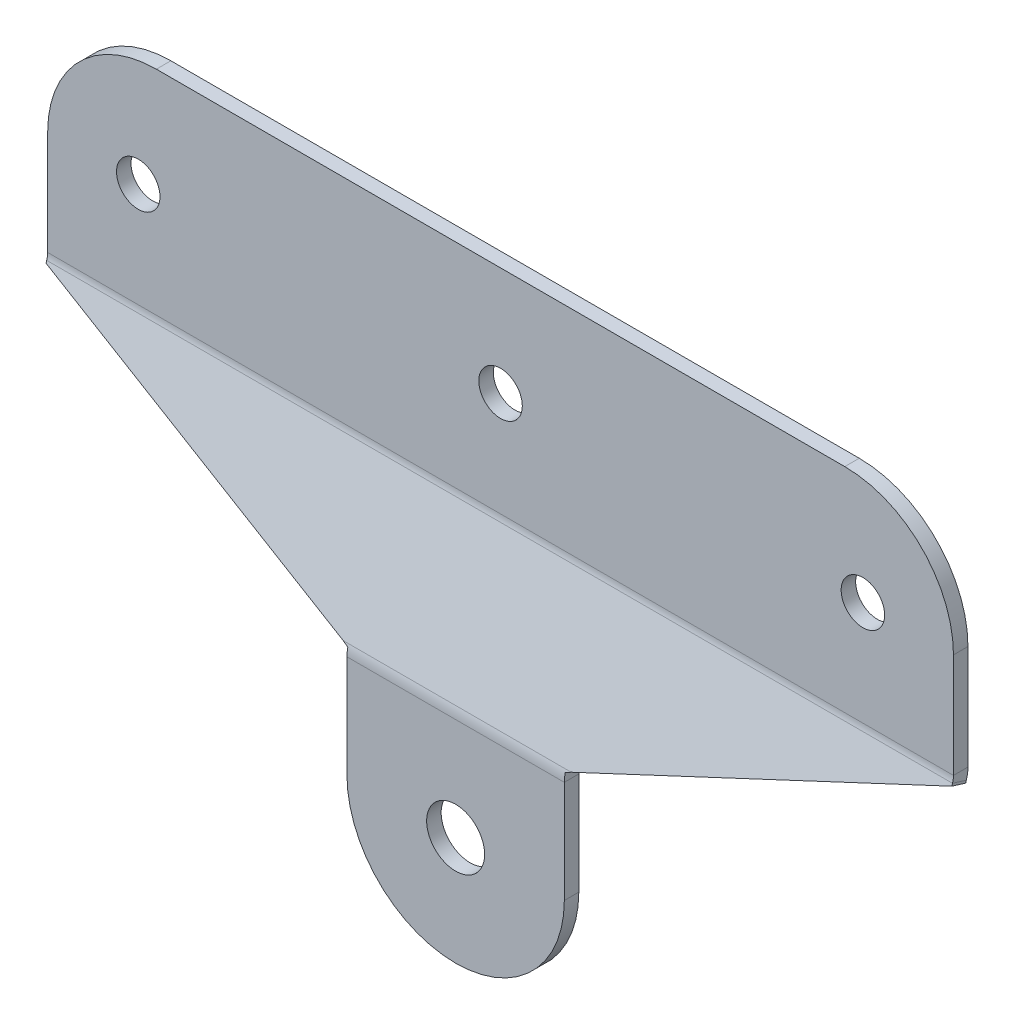
ISO-10303-21;
HEADER;
FILE_DESCRIPTION(('STEP AP214'),'2;1');
FILE_NAME('part.step','',(''),(''),'','','');
FILE_SCHEMA(('AUTOMOTIVE_DESIGN { 1 0 10303 214 1 1 1 1 }'));
ENDSEC;
DATA;
#1=APPLICATION_CONTEXT('core data for automotive mechanical design processes');
#2=APPLICATION_PROTOCOL_DEFINITION('international standard','automotive_design',2000,#1);
#3=PRODUCT_CONTEXT('',#1,'mechanical');
#4=PRODUCT('Part','Part','',(#3));
#5=PRODUCT_RELATED_PRODUCT_CATEGORY('part','',(#4));
#6=PRODUCT_DEFINITION_FORMATION('','',#4);
#7=PRODUCT_DEFINITION_CONTEXT('part definition',#1,'design');
#8=PRODUCT_DEFINITION('design','',#6,#7);
#9=PRODUCT_DEFINITION_SHAPE('','',#8);
#10=(LENGTH_UNIT() NAMED_UNIT(*) SI_UNIT(.MILLI.,.METRE.));
#11=(NAMED_UNIT(*) PLANE_ANGLE_UNIT() SI_UNIT($,.RADIAN.));
#12=(NAMED_UNIT(*) SI_UNIT($,.STERADIAN.) SOLID_ANGLE_UNIT());
#13=UNCERTAINTY_MEASURE_WITH_UNIT(LENGTH_MEASURE(1.E-05),#10,'distance_accuracy_value','');
#14=(GEOMETRIC_REPRESENTATION_CONTEXT(3) GLOBAL_UNCERTAINTY_ASSIGNED_CONTEXT((#13)) GLOBAL_UNIT_ASSIGNED_CONTEXT((#10,
#11,#12)) REPRESENTATION_CONTEXT('',''));
#15=CARTESIAN_POINT('',(0.,0.,0.));
#16=DIRECTION('',(0.,0.,1.));
#17=DIRECTION('',(1.,0.,0.));
#18=AXIS2_PLACEMENT_3D('',#15,#16,#17);
#19=CARTESIAN_POINT('',(0.,-1.02707782370186,-8.81356227173197));
#20=DIRECTION('',(0.,-0.292371704722738,-0.956304755963035));
#21=DIRECTION('',(-1.,0.,0.));
#22=AXIS2_PLACEMENT_3D('',#19,#20,#21);
#23=PLANE('',#22);
#24=DIRECTION('',(0.921635375138065,-0.37110075474034,0.113456886636588));
#25=VECTOR('',#24,1.);
#26=CARTESIAN_POINT('',(47.5000000000001,-49.7116233923811,6.07079702148561));
#27=LINE('',#26,#25);
#28=CARTESIAN_POINT('',(0.,-30.5855282731204,0.223362927030854));
#29=VERTEX_POINT('',#28);
#30=CARTESIAN_POINT('',(46.774813719856,-49.4196237761029,5.98152377981519));
#31=VERTEX_POINT('',#30);
#32=EDGE_CURVE('E586',#29,#31,#27,.T.);
#33=ORIENTED_EDGE('',*,*,#32,.T.);
#34=DIRECTION('',(1.,0.,0.));
#35=VECTOR('',#34,1.);
#36=CARTESIAN_POINT('',(0.,-49.4196237761029,5.98152377981519));
#37=LINE('',#36,#35);
#38=CARTESIAN_POINT('',(78.225186280144,-49.4196237761029,5.98152377981519));
#39=VERTEX_POINT('',#38);
#40=EDGE_CURVE('E517',#31,#39,#37,.T.);
#41=ORIENTED_EDGE('',*,*,#40,.T.);
#42=DIRECTION('',(0.921635375138065,0.37110075474034,-0.113456886636588));
#43=VECTOR('',#42,1.);
#44=CARTESIAN_POINT('',(125.,-30.5855282731204,0.223362927030856));
#45=LINE('',#44,#43);
#46=CARTESIAN_POINT('',(125.,-30.5855282731204,0.223362927030854));
#47=VERTEX_POINT('',#46);
#48=EDGE_CURVE('E449',#39,#47,#45,.T.);
#49=ORIENTED_EDGE('',*,*,#48,.T.);
#50=DIRECTION('',(0.,0.956304755963035,-0.292371704722738));
#51=VECTOR('',#50,1.);
#52=CARTESIAN_POINT('',(125.,-1.02707782370186,-8.81356227173196));
#53=LINE('',#52,#51);
#54=CARTESIAN_POINT('',(125.,-30.2837031684901,0.131085732110894));
#55=VERTEX_POINT('',#54);
#56=EDGE_CURVE('E597',#47,#55,#53,.T.);
#57=ORIENTED_EDGE('',*,*,#56,.T.);
#58=DIRECTION('',(1.,0.,0.));
#59=VECTOR('',#58,1.);
#60=CARTESIAN_POINT('',(0.,-30.2837031684901,0.131085732110901));
#61=LINE('',#60,#59);
#62=CARTESIAN_POINT('',(0.,-30.2837031684901,0.131085732110894));
#63=VERTEX_POINT('',#62);
#64=EDGE_CURVE('E564',#63,#55,#61,.T.);
#65=ORIENTED_EDGE('',*,*,#64,.F.);
#66=DIRECTION('',(0.,-0.956304755963035,0.292371704722738));
#67=VECTOR('',#66,1.);
#68=CARTESIAN_POINT('',(0.,-29.7162205025929,-0.0424111300498346));
#69=LINE('',#68,#67);
#70=EDGE_CURVE('E605',#63,#29,#69,.T.);
#71=ORIENTED_EDGE('',*,*,#70,.T.);
#72=EDGE_LOOP('',(#33,#41,#49,#57,#65,#71));
#73=FACE_BOUND('',#72,.T.);
#74=ADVANCED_FACE('F60',(#73),#23,.F.);
#75=CARTESIAN_POINT('',(0.,-1.61182123314733,-10.726171783658));
#76=DIRECTION('',(0.,-0.292371704722738,-0.956304755963035));
#77=DIRECTION('',(-1.,0.,0.));
#78=AXIS2_PLACEMENT_3D('',#75,#76,#77);
#79=PLANE('',#78);
#80=DIRECTION('',(1.,0.,0.));
#81=VECTOR('',#80,1.);
#82=CARTESIAN_POINT('',(0.,-50.0043671855483,4.06891426788912));
#83=LINE('',#82,#81);
#84=CARTESIAN_POINT('',(46.774813719856,-50.0043671855483,4.06891426788912));
#85=VERTEX_POINT('',#84);
#86=CARTESIAN_POINT('',(78.225186280144,-50.0043671855483,4.06891426788912));
#87=VERTEX_POINT('',#86);
#88=EDGE_CURVE('E551',#85,#87,#83,.T.);
#89=ORIENTED_EDGE('',*,*,#88,.F.);
#90=DIRECTION('',(0.921635375138065,-0.37110075474034,0.113456886636588));
#91=VECTOR('',#90,1.);
#92=CARTESIAN_POINT('',(47.5000000000001,-50.2963668018266,4.15818750955954));
#93=LINE('',#92,#91);
#94=CARTESIAN_POINT('',(0.,-31.1702716825659,-1.68924658489522));
#95=VERTEX_POINT('',#94);
#96=EDGE_CURVE('E601',#95,#85,#93,.T.);
#97=ORIENTED_EDGE('',*,*,#96,.F.);
#98=DIRECTION('',(0.,-0.956304755963035,0.292371704722738));
#99=VECTOR('',#98,1.);
#100=CARTESIAN_POINT('',(0.,-30.3009639120384,-1.9550206419759));
#101=LINE('',#100,#99);
#102=CARTESIAN_POINT('',(0.,-30.8684465779356,-1.78152377981518));
#103=VERTEX_POINT('',#102);
#104=EDGE_CURVE('E604',#103,#95,#101,.T.);
#105=ORIENTED_EDGE('',*,*,#104,.F.);
#106=DIRECTION('',(1.,0.,0.));
#107=VECTOR('',#106,1.);
#108=CARTESIAN_POINT('',(0.,-30.8684465779356,-1.78152377981517));
#109=LINE('',#108,#107);
#110=CARTESIAN_POINT('',(125.,-30.8684465779356,-1.78152377981517));
#111=VERTEX_POINT('',#110);
#112=EDGE_CURVE('E621',#103,#111,#109,.T.);
#113=ORIENTED_EDGE('',*,*,#112,.T.);
#114=DIRECTION('',(0.,0.956304755963035,-0.292371704722738));
#115=VECTOR('',#114,1.);
#116=CARTESIAN_POINT('',(125.,-1.61182123314733,-10.726171783658));
#117=LINE('',#116,#115);
#118=CARTESIAN_POINT('',(125.,-31.1702716825659,-1.68924658489521));
#119=VERTEX_POINT('',#118);
#120=EDGE_CURVE('E607',#119,#111,#117,.T.);
#121=ORIENTED_EDGE('',*,*,#120,.F.);
#122=DIRECTION('',(0.921635375138065,0.37110075474034,-0.113456886636588));
#123=VECTOR('',#122,1.);
#124=CARTESIAN_POINT('',(125.,-31.1702716825659,-1.68924658489521));
#125=LINE('',#124,#123);
#126=EDGE_CURVE('E441',#87,#119,#125,.T.);
#127=ORIENTED_EDGE('',*,*,#126,.F.);
#128=EDGE_LOOP('',(#89,#97,#105,#113,#121,#127));
#129=FACE_BOUND('',#128,.T.);
#130=ADVANCED_FACE('F422',(#129),#79,.T.);
#131=CARTESIAN_POINT('',(0.,-30.3009639120384,-1.9550206419759));
#132=DIRECTION('',(-1.,0.,0.));
#133=DIRECTION('',(0.,0.292371704722738,0.956304755963035));
#134=AXIS2_PLACEMENT_3D('',#131,#132,#133);
#135=PLANE('',#134);
#136=ORIENTED_EDGE('',*,*,#70,.F.);
#137=DIRECTION('',(0.,-0.292371704722731,-0.956304755963037));
#138=VECTOR('',#137,1.);
#139=CARTESIAN_POINT('',(0.,-30.8684465779356,-1.78152377981518));
#140=LINE('',#139,#138);
#141=EDGE_CURVE('E624',#63,#103,#140,.T.);
#142=ORIENTED_EDGE('',*,*,#141,.T.);
#143=ORIENTED_EDGE('',*,*,#104,.T.);
#144=DIRECTION('',(0.,0.292371704722738,0.956304755963035));
#145=VECTOR('',#144,1.);
#146=CARTESIAN_POINT('',(0.,-31.1702716825659,-1.68924658489522));
#147=LINE('',#146,#145);
#148=EDGE_CURVE('E609',#95,#29,#147,.T.);
#149=ORIENTED_EDGE('',*,*,#148,.T.);
#150=EDGE_LOOP('',(#136,#142,#143,#149));
#151=FACE_BOUND('',#150,.T.);
#152=ADVANCED_FACE('F418',(#151),#135,.T.);
#153=CARTESIAN_POINT('',(125.,-1.61182123314733,-10.726171783658));
#154=DIRECTION('',(1.,0.,0.));
#155=DIRECTION('',(0.,-0.292371704722738,-0.956304755963035));
#156=AXIS2_PLACEMENT_3D('',#153,#154,#155);
#157=PLANE('',#156);
#158=ORIENTED_EDGE('',*,*,#120,.T.);
#159=DIRECTION('',(0.,0.292371704722731,0.956304755963037));
#160=VECTOR('',#159,1.);
#161=CARTESIAN_POINT('',(125.,-30.8684465779356,-1.78152377981538));
#162=LINE('',#161,#160);
#163=EDGE_CURVE('E560',#111,#55,#162,.T.);
#164=ORIENTED_EDGE('',*,*,#163,.T.);
#165=ORIENTED_EDGE('',*,*,#56,.F.);
#166=DIRECTION('',(0.,0.292371704722738,0.956304755963035));
#167=VECTOR('',#166,1.);
#168=CARTESIAN_POINT('',(125.,-31.1702716825659,-1.68924658489521));
#169=LINE('',#168,#167);
#170=EDGE_CURVE('E448',#119,#47,#169,.T.);
#171=ORIENTED_EDGE('',*,*,#170,.F.);
#172=EDGE_LOOP('',(#158,#164,#165,#171));
#173=FACE_BOUND('',#172,.T.);
#174=ADVANCED_FACE('F421',(#173),#157,.T.);
#175=CARTESIAN_POINT('',(125.,-31.1702716825659,-1.68924658489521));
#176=DIRECTION('',(0.388057000058133,-0.881364292508308,0.269460105761896));
#177=DIRECTION('',(0.921635375138065,0.37110075474034,-0.113456886636588));
#178=AXIS2_PLACEMENT_3D('',#175,#176,#177);
#179=PLANE('',#178);
#180=CARTESIAN_POINT('',(78.225186280144,-50.0043671855483,4.06891426788912));
#181=CARTESIAN_POINT('',(78.225186280144,-49.4196237761029,5.98152377981519));
#182=B_SPLINE_CURVE_WITH_KNOTS('',1,(#180,#181),.UNSPECIFIED.,.F.,.F.,(2,2),(0.,1.),.UNSPECIFIED.);
#183=EDGE_CURVE('E550',#87,#39,#182,.T.);
#184=ORIENTED_EDGE('',*,*,#183,.F.);
#185=ORIENTED_EDGE('',*,*,#126,.T.);
#186=ORIENTED_EDGE('',*,*,#170,.T.);
#187=ORIENTED_EDGE('',*,*,#48,.F.);
#188=EDGE_LOOP('',(#184,#185,#186,#187));
#189=FACE_BOUND('',#188,.T.);
#190=ADVANCED_FACE('F426',(#189),#179,.T.);
#191=CARTESIAN_POINT('',(47.5000000000001,-50.2963668018266,4.15818750955954));
#192=DIRECTION('',(-0.388057000058132,-0.881364292508308,0.269460105761896));
#193=DIRECTION('',(0.921635375138065,-0.37110075474034,0.113456886636588));
#194=AXIS2_PLACEMENT_3D('',#191,#192,#193);
#195=PLANE('',#194);
#196=CARTESIAN_POINT('',(46.774813719856,-49.4196237761029,5.98152377981519));
#197=CARTESIAN_POINT('',(46.774813719856,-50.0043671855483,4.06891426788912));
#198=B_SPLINE_CURVE_WITH_KNOTS('',1,(#196,#197),.UNSPECIFIED.,.F.,.F.,(2,2),(0.,1.),.UNSPECIFIED.);
#199=EDGE_CURVE('E455',#31,#85,#198,.T.);
#200=ORIENTED_EDGE('',*,*,#199,.F.);
#201=ORIENTED_EDGE('',*,*,#32,.F.);
#202=ORIENTED_EDGE('',*,*,#148,.F.);
#203=ORIENTED_EDGE('',*,*,#96,.T.);
#204=EDGE_LOOP('',(#200,#201,#202,#203));
#205=FACE_BOUND('',#204,.T.);
#206=ADVANCED_FACE('F390',(#205),#195,.T.);
#207=CARTESIAN_POINT('',(12.5,-15.,-2.));
#208=DIRECTION('',(0.,0.,1.));
#209=DIRECTION('',(1.,0.,0.));
#210=AXIS2_PLACEMENT_3D('',#207,#208,#209);
#211=CYLINDRICAL_SURFACE('',#210,3.);
#212=CARTESIAN_POINT('',(12.5,-15.,-2.));
#213=DIRECTION('',(0.,0.,1.));
#214=DIRECTION('',(1.,0.,0.));
#215=AXIS2_PLACEMENT_3D('',#212,#213,#214);
#216=CIRCLE('',#215,3.);
#217=CARTESIAN_POINT('',(15.5,-15.,-2.));
#218=VERTEX_POINT('',#217);
#219=EDGE_CURVE('E658',#218,#218,#216,.T.);
#220=ORIENTED_EDGE('',*,*,#219,.F.);
#221=EDGE_LOOP('',(#220));
#222=FACE_BOUND('',#221,.T.);
#223=CARTESIAN_POINT('',(12.5,-15.,0.));
#224=DIRECTION('',(0.,0.,1.));
#225=DIRECTION('',(1.,0.,0.));
#226=AXIS2_PLACEMENT_3D('',#223,#224,#225);
#227=CIRCLE('',#226,3.);
#228=CARTESIAN_POINT('',(15.5,-15.,0.));
#229=VERTEX_POINT('',#228);
#230=EDGE_CURVE('E676',#229,#229,#227,.T.);
#231=ORIENTED_EDGE('',*,*,#230,.T.);
#232=EDGE_LOOP('',(#231));
#233=FACE_BOUND('',#232,.T.);
#234=ADVANCED_FACE('F386',(#222,#233),#211,.F.);
#235=CARTESIAN_POINT('',(62.5,-15.,-2.));
#236=DIRECTION('',(0.,0.,1.));
#237=DIRECTION('',(1.,0.,0.));
#238=AXIS2_PLACEMENT_3D('',#235,#236,#237);
#239=CYLINDRICAL_SURFACE('',#238,3.00000000000001);
#240=CARTESIAN_POINT('',(62.5,-15.,-2.));
#241=DIRECTION('',(0.,0.,1.));
#242=DIRECTION('',(1.,0.,0.));
#243=AXIS2_PLACEMENT_3D('',#240,#241,#242);
#244=CIRCLE('',#243,3.00000000000001);
#245=CARTESIAN_POINT('',(65.5,-15.,-2.));
#246=VERTEX_POINT('',#245);
#247=EDGE_CURVE('E661',#246,#246,#244,.T.);
#248=ORIENTED_EDGE('',*,*,#247,.F.);
#249=EDGE_LOOP('',(#248));
#250=FACE_BOUND('',#249,.T.);
#251=CARTESIAN_POINT('',(62.5,-15.,0.));
#252=DIRECTION('',(0.,0.,1.));
#253=DIRECTION('',(1.,0.,0.));
#254=AXIS2_PLACEMENT_3D('',#251,#252,#253);
#255=CIRCLE('',#254,3.00000000000001);
#256=CARTESIAN_POINT('',(65.5,-15.,0.));
#257=VERTEX_POINT('',#256);
#258=EDGE_CURVE('E673',#257,#257,#255,.T.);
#259=ORIENTED_EDGE('',*,*,#258,.T.);
#260=EDGE_LOOP('',(#259));
#261=FACE_BOUND('',#260,.T.);
#262=ADVANCED_FACE('F389',(#250,#261),#239,.F.);
#263=CARTESIAN_POINT('',(112.5,-15.,-2.));
#264=DIRECTION('',(0.,0.,1.));
#265=DIRECTION('',(1.,0.,0.));
#266=AXIS2_PLACEMENT_3D('',#263,#264,#265);
#267=CYLINDRICAL_SURFACE('',#266,2.99999999999999);
#268=CARTESIAN_POINT('',(112.5,-15.,-2.));
#269=DIRECTION('',(0.,0.,1.));
#270=DIRECTION('',(1.,0.,0.));
#271=AXIS2_PLACEMENT_3D('',#268,#269,#270);
#272=CIRCLE('',#271,2.99999999999999);
#273=CARTESIAN_POINT('',(115.5,-15.,-2.));
#274=VERTEX_POINT('',#273);
#275=EDGE_CURVE('E664',#274,#274,#272,.T.);
#276=ORIENTED_EDGE('',*,*,#275,.F.);
#277=EDGE_LOOP('',(#276));
#278=FACE_BOUND('',#277,.T.);
#279=CARTESIAN_POINT('',(112.5,-15.,0.));
#280=DIRECTION('',(0.,0.,1.));
#281=DIRECTION('',(1.,0.,0.));
#282=AXIS2_PLACEMENT_3D('',#279,#280,#281);
#283=CIRCLE('',#282,2.99999999999999);
#284=CARTESIAN_POINT('',(115.5,-15.,0.));
#285=VERTEX_POINT('',#284);
#286=EDGE_CURVE('E670',#285,#285,#283,.T.);
#287=ORIENTED_EDGE('',*,*,#286,.T.);
#288=EDGE_LOOP('',(#287));
#289=FACE_BOUND('',#288,.T.);
#290=ADVANCED_FACE('F394',(#278,#289),#267,.F.);
#291=CARTESIAN_POINT('',(0.,0.,-2.));
#292=DIRECTION('',(0.,1.,0.));
#293=DIRECTION('',(0.,0.,1.));
#294=AXIS2_PLACEMENT_3D('',#291,#292,#293);
#295=PLANE('',#294);
#296=DIRECTION('',(-1.,0.,0.));
#297=VECTOR('',#296,1.);
#298=CARTESIAN_POINT('',(0.,0.,-2.));
#299=LINE('',#298,#297);
#300=CARTESIAN_POINT('',(110.,0.,-2.));
#301=VERTEX_POINT('',#300);
#302=CARTESIAN_POINT('',(15.,0.,-2.));
#303=VERTEX_POINT('',#302);
#304=EDGE_CURVE('E667',#301,#303,#299,.T.);
#305=ORIENTED_EDGE('',*,*,#304,.T.);
#306=DIRECTION('',(0.,0.,1.));
#307=VECTOR('',#306,1.);
#308=CARTESIAN_POINT('',(15.,0.,-2.));
#309=LINE('',#308,#307);
#310=CARTESIAN_POINT('',(15.,0.,0.));
#311=VERTEX_POINT('',#310);
#312=EDGE_CURVE('E454',#303,#311,#309,.T.);
#313=ORIENTED_EDGE('',*,*,#312,.T.);
#314=DIRECTION('',(-1.,0.,0.));
#315=VECTOR('',#314,1.);
#316=CARTESIAN_POINT('',(0.,0.,0.));
#317=LINE('',#316,#315);
#318=CARTESIAN_POINT('',(110.,0.,0.));
#319=VERTEX_POINT('',#318);
#320=EDGE_CURVE('E645',#319,#311,#317,.T.);
#321=ORIENTED_EDGE('',*,*,#320,.F.);
#322=DIRECTION('',(0.,0.,1.));
#323=VECTOR('',#322,1.);
#324=CARTESIAN_POINT('',(110.,0.,-2.));
#325=LINE('',#324,#323);
#326=EDGE_CURVE('E452',#319,#301,#325,.F.);
#327=ORIENTED_EDGE('',*,*,#326,.T.);
#328=EDGE_LOOP('',(#305,#313,#321,#327));
#329=FACE_BOUND('',#328,.T.);
#330=ADVANCED_FACE('F398',(#329),#295,.T.);
#331=CARTESIAN_POINT('',(0.,0.,-2.));
#332=DIRECTION('',(0.,0.,-1.));
#333=DIRECTION('',(-1.,0.,0.));
#334=AXIS2_PLACEMENT_3D('',#331,#332,#333);
#335=PLANE('',#334);
#336=DIRECTION('',(0.,-1.,0.));
#337=VECTOR('',#336,1.);
#338=CARTESIAN_POINT('',(0.,-30.,-2.));
#339=LINE('',#338,#337);
#340=CARTESIAN_POINT('',(0.,-15.,-2.));
#341=VERTEX_POINT('',#340);
#342=CARTESIAN_POINT('',(0.,-29.4065880543219,-2.));
#343=VERTEX_POINT('',#342);
#344=EDGE_CURVE('E656',#341,#343,#339,.T.);
#345=ORIENTED_EDGE('',*,*,#344,.F.);
#346=CARTESIAN_POINT('',(15.,-15.,-2.));
#347=DIRECTION('',(0.,0.,-1.));
#348=DIRECTION('',(-1.,0.,0.));
#349=AXIS2_PLACEMENT_3D('',#346,#347,#348);
#350=CIRCLE('',#349,15.);
#351=EDGE_CURVE('E466',#341,#303,#350,.T.);
#352=ORIENTED_EDGE('',*,*,#351,.T.);
#353=ORIENTED_EDGE('',*,*,#304,.F.);
#354=CARTESIAN_POINT('',(110.,-15.,-2.));
#355=DIRECTION('',(0.,0.,-1.));
#356=DIRECTION('',(-1.,0.,0.));
#357=AXIS2_PLACEMENT_3D('',#354,#355,#356);
#358=CIRCLE('',#357,15.);
#359=CARTESIAN_POINT('',(125.,-15.,-2.));
#360=VERTEX_POINT('',#359);
#361=EDGE_CURVE('E464',#301,#360,#358,.T.);
#362=ORIENTED_EDGE('',*,*,#361,.T.);
#363=DIRECTION('',(0.,1.,0.));
#364=VECTOR('',#363,1.);
#365=CARTESIAN_POINT('',(125.,0.,-2.));
#366=LINE('',#365,#364);
#367=CARTESIAN_POINT('',(125.,-29.4065880543219,-2.));
#368=VERTEX_POINT('',#367);
#369=EDGE_CURVE('E588',#368,#360,#366,.T.);
#370=ORIENTED_EDGE('',*,*,#369,.F.);
#371=DIRECTION('',(1.,0.,0.));
#372=VECTOR('',#371,1.);
#373=CARTESIAN_POINT('',(0.,-29.4065880543219,-2.));
#374=LINE('',#373,#372);
#375=EDGE_CURVE('E618',#343,#368,#374,.T.);
#376=ORIENTED_EDGE('',*,*,#375,.F.);
#377=EDGE_LOOP('',(#345,#352,#353,#362,#370,#376));
#378=FACE_BOUND('',#377,.T.);
#379=ORIENTED_EDGE('',*,*,#275,.T.);
#380=EDGE_LOOP('',(#379));
#381=FACE_BOUND('',#380,.T.);
#382=ORIENTED_EDGE('',*,*,#247,.T.);
#383=EDGE_LOOP('',(#382));
#384=FACE_BOUND('',#383,.T.);
#385=ORIENTED_EDGE('',*,*,#219,.T.);
#386=EDGE_LOOP('',(#385));
#387=FACE_BOUND('',#386,.T.);
#388=ADVANCED_FACE('F402',(#378,#381,#384,#387),#335,.T.);
#389=CARTESIAN_POINT('',(0.,-30.,-2.));
#390=DIRECTION('',(-1.,0.,0.));
#391=DIRECTION('',(0.,0.,1.));
#392=AXIS2_PLACEMENT_3D('',#389,#390,#391);
#393=PLANE('',#392);
#394=DIRECTION('',(0.,-1.,0.));
#395=VECTOR('',#394,1.);
#396=CARTESIAN_POINT('',(0.,-30.,0.));
#397=LINE('',#396,#395);
#398=CARTESIAN_POINT('',(0.,-15.,0.));
#399=VERTEX_POINT('',#398);
#400=CARTESIAN_POINT('',(0.,-29.4065880543219,0.));
#401=VERTEX_POINT('',#400);
#402=EDGE_CURVE('E654',#399,#401,#397,.T.);
#403=ORIENTED_EDGE('',*,*,#402,.F.);
#404=DIRECTION('',(0.,0.,1.));
#405=VECTOR('',#404,1.);
#406=CARTESIAN_POINT('',(0.,-15.,-2.));
#407=LINE('',#406,#405);
#408=EDGE_CURVE('E462',#399,#341,#407,.F.);
#409=ORIENTED_EDGE('',*,*,#408,.T.);
#410=ORIENTED_EDGE('',*,*,#344,.T.);
#411=DIRECTION('',(0.,0.,-1.));
#412=VECTOR('',#411,1.);
#413=CARTESIAN_POINT('',(0.,-29.4065880543219,-2.));
#414=LINE('',#413,#412);
#415=EDGE_CURVE('E679',#401,#343,#414,.T.);
#416=ORIENTED_EDGE('',*,*,#415,.F.);
#417=EDGE_LOOP('',(#403,#409,#410,#416));
#418=FACE_BOUND('',#417,.T.);
#419=ADVANCED_FACE('F406',(#418),#393,.T.);
#420=CARTESIAN_POINT('',(0.,0.,0.));
#421=DIRECTION('',(0.,0.,-1.));
#422=DIRECTION('',(-1.,0.,0.));
#423=AXIS2_PLACEMENT_3D('',#420,#421,#422);
#424=PLANE('',#423);
#425=ORIENTED_EDGE('',*,*,#230,.F.);
#426=EDGE_LOOP('',(#425));
#427=FACE_BOUND('',#426,.T.);
#428=ORIENTED_EDGE('',*,*,#258,.F.);
#429=EDGE_LOOP('',(#428));
#430=FACE_BOUND('',#429,.T.);
#431=ORIENTED_EDGE('',*,*,#286,.F.);
#432=EDGE_LOOP('',(#431));
#433=FACE_BOUND('',#432,.T.);
#434=ORIENTED_EDGE('',*,*,#320,.T.);
#435=CARTESIAN_POINT('',(15.,-15.,0.));
#436=DIRECTION('',(0.,0.,-1.));
#437=DIRECTION('',(-1.,0.,0.));
#438=AXIS2_PLACEMENT_3D('',#435,#436,#437);
#439=CIRCLE('',#438,15.);
#440=EDGE_CURVE('E460',#311,#399,#439,.F.);
#441=ORIENTED_EDGE('',*,*,#440,.T.);
#442=ORIENTED_EDGE('',*,*,#402,.T.);
#443=DIRECTION('',(1.,0.,0.));
#444=VECTOR('',#443,1.);
#445=CARTESIAN_POINT('',(0.,-29.4065880543219,0.));
#446=LINE('',#445,#444);
#447=CARTESIAN_POINT('',(125.,-29.4065880543219,0.));
#448=VERTEX_POINT('',#447);
#449=EDGE_CURVE('E651',#401,#448,#446,.T.);
#450=ORIENTED_EDGE('',*,*,#449,.T.);
#451=DIRECTION('',(0.,1.,0.));
#452=VECTOR('',#451,1.);
#453=CARTESIAN_POINT('',(125.,0.,0.));
#454=LINE('',#453,#452);
#455=CARTESIAN_POINT('',(125.,-15.,0.));
#456=VERTEX_POINT('',#455);
#457=EDGE_CURVE('E648',#448,#456,#454,.T.);
#458=ORIENTED_EDGE('',*,*,#457,.T.);
#459=CARTESIAN_POINT('',(110.,-15.,0.));
#460=DIRECTION('',(0.,0.,-1.));
#461=DIRECTION('',(-1.,0.,0.));
#462=AXIS2_PLACEMENT_3D('',#459,#460,#461);
#463=CIRCLE('',#462,15.);
#464=EDGE_CURVE('E458',#456,#319,#463,.F.);
#465=ORIENTED_EDGE('',*,*,#464,.T.);
#466=EDGE_LOOP('',(#434,#441,#442,#450,#458,#465));
#467=FACE_BOUND('',#466,.T.);
#468=ADVANCED_FACE('F410',(#427,#430,#433,#467),#424,.F.);
#469=CARTESIAN_POINT('',(125.,0.,-2.));
#470=DIRECTION('',(1.,0.,0.));
#471=DIRECTION('',(0.,0.,-1.));
#472=AXIS2_PLACEMENT_3D('',#469,#470,#471);
#473=PLANE('',#472);
#474=ORIENTED_EDGE('',*,*,#369,.T.);
#475=DIRECTION('',(0.,0.,1.));
#476=VECTOR('',#475,1.);
#477=CARTESIAN_POINT('',(125.,-15.,-2.));
#478=LINE('',#477,#476);
#479=EDGE_CURVE('E468',#360,#456,#478,.T.);
#480=ORIENTED_EDGE('',*,*,#479,.T.);
#481=ORIENTED_EDGE('',*,*,#457,.F.);
#482=DIRECTION('',(0.,0.,1.));
#483=VECTOR('',#482,1.);
#484=CARTESIAN_POINT('',(125.,-29.4065880543219,-2.00000000000021));
#485=LINE('',#484,#483);
#486=EDGE_CURVE('E637',#368,#448,#485,.T.);
#487=ORIENTED_EDGE('',*,*,#486,.F.);
#488=EDGE_LOOP('',(#474,#480,#481,#487));
#489=FACE_BOUND('',#488,.T.);
#490=ADVANCED_FACE('F381',(#489),#473,.T.);
#491=CARTESIAN_POINT('',(0.,-29.4065880543219,3.));
#492=DIRECTION('',(-1.,0.,0.));
#493=DIRECTION('',(0.,-1.,0.));
#494=AXIS2_PLACEMENT_3D('',#491,#492,#493);
#495=PLANE('',#494);
#496=ORIENTED_EDGE('',*,*,#141,.F.);
#497=CARTESIAN_POINT('',(0.,-29.4065880543219,3.));
#498=DIRECTION('',(-1.,0.,0.));
#499=DIRECTION('',(0.,-1.,0.));
#500=AXIS2_PLACEMENT_3D('',#497,#498,#499);
#501=CIRCLE('',#500,3.);
#502=EDGE_CURVE('E633',#63,#401,#501,.F.);
#503=ORIENTED_EDGE('',*,*,#502,.T.);
#504=ORIENTED_EDGE('',*,*,#415,.T.);
#505=CARTESIAN_POINT('',(0.,-29.4065880543219,3.));
#506=DIRECTION('',(1.,0.,0.));
#507=DIRECTION('',(0.,-1.,0.));
#508=AXIS2_PLACEMENT_3D('',#505,#506,#507);
#509=CIRCLE('',#508,5.);
#510=EDGE_CURVE('E359',#103,#343,#509,.T.);
#511=ORIENTED_EDGE('',*,*,#510,.F.);
#512=EDGE_LOOP('',(#496,#503,#504,#511));
#513=FACE_BOUND('',#512,.T.);
#514=ADVANCED_FACE('F378',(#513),#495,.T.);
#515=CARTESIAN_POINT('',(125.,-29.4065880543219,3.));
#516=DIRECTION('',(1.,0.,0.));
#517=DIRECTION('',(0.,0.,-1.));
#518=AXIS2_PLACEMENT_3D('',#515,#516,#517);
#519=PLANE('',#518);
#520=CARTESIAN_POINT('',(125.,-29.4065880543219,3.));
#521=DIRECTION('',(-1.,0.,0.));
#522=DIRECTION('',(0.,-1.,0.));
#523=AXIS2_PLACEMENT_3D('',#520,#521,#522);
#524=CIRCLE('',#523,3.);
#525=EDGE_CURVE('E631',#448,#55,#524,.T.);
#526=ORIENTED_EDGE('',*,*,#525,.T.);
#527=ORIENTED_EDGE('',*,*,#163,.F.);
#528=CARTESIAN_POINT('',(125.,-29.4065880543219,3.));
#529=DIRECTION('',(-1.,0.,0.));
#530=DIRECTION('',(0.,0.,-1.));
#531=AXIS2_PLACEMENT_3D('',#528,#529,#530);
#532=CIRCLE('',#531,5.);
#533=EDGE_CURVE('E640',#368,#111,#532,.T.);
#534=ORIENTED_EDGE('',*,*,#533,.F.);
#535=ORIENTED_EDGE('',*,*,#486,.T.);
#536=EDGE_LOOP('',(#526,#527,#534,#535));
#537=FACE_BOUND('',#536,.T.);
#538=ADVANCED_FACE('F373',(#537),#519,.T.);
#539=CARTESIAN_POINT('',(187.521632331965,-29.4065880543219,3.));
#540=DIRECTION('',(-1.,0.,0.));
#541=DIRECTION('',(0.,-1.,0.));
#542=AXIS2_PLACEMENT_3D('',#539,#540,#541);
#543=CYLINDRICAL_SURFACE('',#542,5.);
#544=ORIENTED_EDGE('',*,*,#375,.T.);
#545=ORIENTED_EDGE('',*,*,#533,.T.);
#546=ORIENTED_EDGE('',*,*,#112,.F.);
#547=ORIENTED_EDGE('',*,*,#510,.T.);
#548=EDGE_LOOP('',(#544,#545,#546,#547));
#549=FACE_BOUND('',#548,.T.);
#550=ADVANCED_FACE('F369',(#549),#543,.T.);
#551=CARTESIAN_POINT('',(187.521632331965,-29.4065880543219,3.));
#552=DIRECTION('',(-1.,0.,0.));
#553=DIRECTION('',(0.,-1.,0.));
#554=AXIS2_PLACEMENT_3D('',#551,#552,#553);
#555=CYLINDRICAL_SURFACE('',#554,3.);
#556=ORIENTED_EDGE('',*,*,#449,.F.);
#557=ORIENTED_EDGE('',*,*,#502,.F.);
#558=ORIENTED_EDGE('',*,*,#64,.T.);
#559=ORIENTED_EDGE('',*,*,#525,.F.);
#560=EDGE_LOOP('',(#556,#557,#558,#559));
#561=FACE_BOUND('',#560,.T.);
#562=ADVANCED_FACE('F372',(#561),#555,.F.);
#563=CARTESIAN_POINT('',(47.5000000000001,-50.8814822997166,1.20000000000001));
#564=DIRECTION('',(1.,0.,0.));
#565=DIRECTION('',(0.,0.,-1.));
#566=AXIS2_PLACEMENT_3D('',#563,#564,#565);
#567=PLANE('',#566);
#568=DIRECTION('',(0.,0.,-1.));
#569=VECTOR('',#568,1.);
#570=CARTESIAN_POINT('',(47.5000000000001,-50.8814822997165,4.20000000000022));
#571=LINE('',#570,#569);
#572=CARTESIAN_POINT('',(47.5000000000001,-50.8814822997166,6.20000000000001));
#573=VERTEX_POINT('',#572);
#574=CARTESIAN_POINT('',(47.5000000000001,-50.8814822997166,4.20000000000001));
#575=VERTEX_POINT('',#574);
#576=EDGE_CURVE('E487',#573,#575,#571,.T.);
#577=ORIENTED_EDGE('',*,*,#576,.F.);
#578=CARTESIAN_POINT('',(47.5000000000001,-50.8814822997166,1.20000000000001));
#579=DIRECTION('',(-1.,0.,0.));
#580=DIRECTION('',(0.,0.,1.));
#581=AXIS2_PLACEMENT_3D('',#578,#579,#580);
#582=CIRCLE('',#581,5.);
#583=CARTESIAN_POINT('',(47.5000000000001,-49.7885260436343,6.07908255948706));
#584=VERTEX_POINT('',#583);
#585=EDGE_CURVE('E269',#573,#584,#582,.T.);
#586=ORIENTED_EDGE('',*,*,#585,.T.);
#587=CARTESIAN_POINT('',(47.5000000000001,-50.2257085460672,4.12744953569224));
#588=CARTESIAN_POINT('',(47.5000000000001,-49.7885260436343,6.07908255948706));
#589=B_SPLINE_CURVE_WITH_KNOTS('',1,(#587,#588),.UNSPECIFIED.,.F.,.F.,(2,2),(0.,1.),.UNSPECIFIED.);
#590=CARTESIAN_POINT('',(47.5000000000001,-50.2257085460672,4.12744953569224));
#591=VERTEX_POINT('',#590);
#592=EDGE_CURVE('E225',#584,#591,#589,.F.);
#593=ORIENTED_EDGE('',*,*,#592,.T.);
#594=CARTESIAN_POINT('',(47.5000000000001,-50.8814822997166,1.20000000000001));
#595=DIRECTION('',(-1.,0.,0.));
#596=DIRECTION('',(0.,0.,-1.));
#597=AXIS2_PLACEMENT_3D('',#594,#595,#596);
#598=CIRCLE('',#597,3.);
#599=EDGE_CURVE('E515',#575,#591,#598,.T.);
#600=ORIENTED_EDGE('',*,*,#599,.F.);
#601=EDGE_LOOP('',(#577,#586,#593,#600));
#602=FACE_BOUND('',#601,.T.);
#603=ADVANCED_FACE('F301',(#602),#567,.F.);
#604=CARTESIAN_POINT('',(47.5000000000001,-49.7885260436343,6.07908255948706));
#605=CARTESIAN_POINT('',(47.2582711853697,-49.6643771127303,6.05127213630542));
#606=CARTESIAN_POINT('',(47.0165425344864,-49.5412903103578,6.01872097224366));
#607=CARTESIAN_POINT('',(46.774813719856,-49.4196237761029,5.98152377981519));
#608=CARTESIAN_POINT('',(47.5000000000001,-50.2257085460672,4.12744953569224));
#609=CARTESIAN_POINT('',(47.2582712171094,-50.1512191973055,4.11076328397421));
#610=CARTESIAN_POINT('',(47.0165425027467,-50.0773670965162,4.09123258041574));
#611=CARTESIAN_POINT('',(46.774813719856,-50.0043671855483,4.06891426788912));
#612=B_SPLINE_SURFACE_WITH_KNOTS('',1,3,((#604,#605,#606,#607),(#608,#609,#610,#611)),
.UNSPECIFIED.,.F.,.F.,.F.,(2,2),(4,4),(0.,1.),(0.,1.),.UNSPECIFIED.);
#613=CARTESIAN_POINT('',(47.5000000000001,-49.7885260436343,6.07908255948706));
#614=CARTESIAN_POINT('',(47.2582711853697,-49.6643771127303,6.05127213630542));
#615=CARTESIAN_POINT('',(47.0165425344864,-49.5412903103578,6.01872097224366));
#616=CARTESIAN_POINT('',(46.774813719856,-49.4196237761029,5.98152377981519));
#617=B_SPLINE_CURVE_WITH_KNOTS('',3,(#613,#614,#615,#616),.UNSPECIFIED.,.F.,.F.,(4,4),(0.,1.),.UNSPECIFIED.);
#618=EDGE_CURVE('E277',#584,#31,#617,.T.);
#619=CARTESIAN_POINT('',(46.774813719856,-50.0043671855483,4.06891426788912));
#620=CARTESIAN_POINT('',(47.0165425027467,-50.0773670965162,4.09123258041574));
#621=CARTESIAN_POINT('',(47.2582712171094,-50.1512191973055,4.11076328397421));
#622=CARTESIAN_POINT('',(47.5000000000001,-50.2257085460672,4.12744953569224));
#623=B_SPLINE_CURVE_WITH_KNOTS('',3,(#619,#620,#621,#622),.UNSPECIFIED.,.F.,.F.,(4,4),(0.,1.),.UNSPECIFIED.);
#624=EDGE_CURVE('E227',#591,#85,#623,.F.);
#625=ORIENTED_EDGE('',*,*,#592,.F.);
#626=ORIENTED_EDGE('',*,*,#618,.T.);
#627=ORIENTED_EDGE('',*,*,#199,.T.);
#628=ORIENTED_EDGE('',*,*,#624,.F.);
#629=EDGE_LOOP('',(#625,#626,#627,#628));
#630=FACE_BOUND('',#629,.T.);
#631=ADVANCED_FACE('F290',(#630),#612,.F.);
#632=CARTESIAN_POINT('',(78.225186280144,-49.4196237761029,5.98152377981519));
#633=CARTESIAN_POINT('',(77.9834574655138,-49.5412903103577,6.01872097224364));
#634=CARTESIAN_POINT('',(77.7417288146303,-49.6643771127303,6.05127213630543));
#635=CARTESIAN_POINT('',(77.5,-49.7885260436343,6.07908255948706));
#636=CARTESIAN_POINT('',(78.225186280144,-50.0043671855483,4.06891426788912));
#637=CARTESIAN_POINT('',(77.9834574972534,-50.0773670965162,4.09123258041574));
#638=CARTESIAN_POINT('',(77.7417287828907,-50.1512191973054,4.11076328397421));
#639=CARTESIAN_POINT('',(77.5,-50.2257085460672,4.12744953569224));
#640=B_SPLINE_SURFACE_WITH_KNOTS('',1,3,((#632,#633,#634,#635),(#636,#637,#638,#639)),
.UNSPECIFIED.,.F.,.F.,.F.,(2,2),(4,4),(0.,1.),(0.,1.),.UNSPECIFIED.);
#641=CARTESIAN_POINT('',(78.225186280144,-49.4196237761029,5.98152377981519));
#642=CARTESIAN_POINT('',(77.9834574655138,-49.5412903103577,6.01872097224364));
#643=CARTESIAN_POINT('',(77.7417288146303,-49.6643771127303,6.05127213630543));
#644=CARTESIAN_POINT('',(77.5,-49.7885260436343,6.07908255948706));
#645=B_SPLINE_CURVE_WITH_KNOTS('',3,(#641,#642,#643,#644),.UNSPECIFIED.,.F.,.F.,(4,4),(0.,1.),.UNSPECIFIED.);
#646=CARTESIAN_POINT('',(77.5,-49.7885260436343,6.07908255948706));
#647=VERTEX_POINT('',#646);
#648=EDGE_CURVE('E237',#39,#647,#645,.T.);
#649=CARTESIAN_POINT('',(77.5,-49.7885260436343,6.07908255948706));
#650=CARTESIAN_POINT('',(77.5,-50.2257085460672,4.12744953569224));
#651=B_SPLINE_CURVE_WITH_KNOTS('',1,(#649,#650),.UNSPECIFIED.,.F.,.F.,(2,2),(0.,1.),.UNSPECIFIED.);
#652=CARTESIAN_POINT('',(77.5,-50.2257085460672,4.12744953569224));
#653=VERTEX_POINT('',#652);
#654=EDGE_CURVE('E223',#647,#653,#651,.T.);
#655=CARTESIAN_POINT('',(77.5,-50.2257085460672,4.12744953569224));
#656=CARTESIAN_POINT('',(77.7417287828907,-50.1512191973054,4.11076328397421));
#657=CARTESIAN_POINT('',(77.9834574972534,-50.0773670965162,4.09123258041574));
#658=CARTESIAN_POINT('',(78.225186280144,-50.0043671855483,4.06891426788912));
#659=B_SPLINE_CURVE_WITH_KNOTS('',3,(#655,#656,#657,#658),.UNSPECIFIED.,.F.,.F.,(4,4),(0.,1.),.UNSPECIFIED.);
#660=EDGE_CURVE('E221',#87,#653,#659,.F.);
#661=ORIENTED_EDGE('',*,*,#183,.T.);
#662=ORIENTED_EDGE('',*,*,#648,.T.);
#663=ORIENTED_EDGE('',*,*,#654,.T.);
#664=ORIENTED_EDGE('',*,*,#660,.F.);
#665=EDGE_LOOP('',(#661,#662,#663,#664));
#666=FACE_BOUND('',#665,.T.);
#667=ADVANCED_FACE('F256',(#666),#640,.F.);
#668=CARTESIAN_POINT('',(77.5,-50.8814822997166,1.20000000000001));
#669=DIRECTION('',(-1.,0.,0.));
#670=DIRECTION('',(0.,0.,1.));
#671=AXIS2_PLACEMENT_3D('',#668,#669,#670);
#672=PLANE('',#671);
#673=CARTESIAN_POINT('',(77.5,-50.8814822997166,1.20000000000001));
#674=DIRECTION('',(-1.,0.,0.));
#675=DIRECTION('',(0.,0.,1.));
#676=AXIS2_PLACEMENT_3D('',#673,#674,#675);
#677=CIRCLE('',#676,5.);
#678=CARTESIAN_POINT('',(77.5,-50.8814822997166,6.20000000000001));
#679=VERTEX_POINT('',#678);
#680=EDGE_CURVE('E214',#647,#679,#677,.F.);
#681=ORIENTED_EDGE('',*,*,#680,.T.);
#682=DIRECTION('',(0.,0.,1.));
#683=VECTOR('',#682,1.);
#684=CARTESIAN_POINT('',(77.5,-50.8814822997166,4.20000000000001));
#685=LINE('',#684,#683);
#686=CARTESIAN_POINT('',(77.5,-50.8814822997166,4.20000000000001));
#687=VERTEX_POINT('',#686);
#688=EDGE_CURVE('E193',#687,#679,#685,.T.);
#689=ORIENTED_EDGE('',*,*,#688,.F.);
#690=CARTESIAN_POINT('',(77.5,-50.8814822997166,1.20000000000001));
#691=DIRECTION('',(1.,0.,0.));
#692=DIRECTION('',(0.,0.,1.));
#693=AXIS2_PLACEMENT_3D('',#690,#691,#692);
#694=CIRCLE('',#693,3.);
#695=EDGE_CURVE('E212',#653,#687,#694,.T.);
#696=ORIENTED_EDGE('',*,*,#695,.F.);
#697=ORIENTED_EDGE('',*,*,#654,.F.);
#698=EDGE_LOOP('',(#681,#689,#696,#697));
#699=FACE_BOUND('',#698,.T.);
#700=ADVANCED_FACE('F211',(#699),#672,.F.);
#701=CARTESIAN_POINT('',(94.0783017136906,-50.8814822997166,1.20000000000001));
#702=DIRECTION('',(-1.,0.,0.));
#703=DIRECTION('',(0.,0.,1.));
#704=AXIS2_PLACEMENT_3D('',#701,#702,#703);
#705=CYLINDRICAL_SURFACE('',#704,3.);
#706=ORIENTED_EDGE('',*,*,#660,.T.);
#707=ORIENTED_EDGE('',*,*,#695,.T.);
#708=DIRECTION('',(1.,0.,0.));
#709=VECTOR('',#708,1.);
#710=CARTESIAN_POINT('',(0.,-50.8814822997166,4.20000000000001));
#711=LINE('',#710,#709);
#712=EDGE_CURVE('E195',#575,#687,#711,.T.);
#713=ORIENTED_EDGE('',*,*,#712,.F.);
#714=ORIENTED_EDGE('',*,*,#599,.T.);
#715=ORIENTED_EDGE('',*,*,#624,.T.);
#716=ORIENTED_EDGE('',*,*,#88,.T.);
#717=EDGE_LOOP('',(#706,#707,#713,#714,#715,#716));
#718=FACE_BOUND('',#717,.T.);
#719=ADVANCED_FACE('F218',(#718),#705,.F.);
#720=CARTESIAN_POINT('',(94.0783017136906,-50.8814822997166,1.20000000000001));
#721=DIRECTION('',(-1.,0.,0.));
#722=DIRECTION('',(0.,0.,1.));
#723=AXIS2_PLACEMENT_3D('',#720,#721,#722);
#724=CYLINDRICAL_SURFACE('',#723,5.);
#725=ORIENTED_EDGE('',*,*,#648,.F.);
#726=ORIENTED_EDGE('',*,*,#40,.F.);
#727=ORIENTED_EDGE('',*,*,#618,.F.);
#728=ORIENTED_EDGE('',*,*,#585,.F.);
#729=DIRECTION('',(1.,0.,0.));
#730=VECTOR('',#729,1.);
#731=CARTESIAN_POINT('',(0.,-50.8814822997166,6.20000000000001));
#732=LINE('',#731,#730);
#733=EDGE_CURVE('E496',#573,#679,#732,.T.);
#734=ORIENTED_EDGE('',*,*,#733,.T.);
#735=ORIENTED_EDGE('',*,*,#680,.F.);
#736=EDGE_LOOP('',(#725,#726,#727,#728,#734,#735));
#737=FACE_BOUND('',#736,.T.);
#738=ADVANCED_FACE('F243',(#737),#724,.T.);
#739=CARTESIAN_POINT('',(62.5,-65.,4.20000000000001));
#740=DIRECTION('',(0.,0.,1.));
#741=DIRECTION('',(1.,0.,0.));
#742=AXIS2_PLACEMENT_3D('',#739,#740,#741);
#743=CYLINDRICAL_SURFACE('',#742,4.00000000000001);
#744=CARTESIAN_POINT('',(62.5,-65.,4.20000000000001));
#745=DIRECTION('',(0.,0.,1.));
#746=DIRECTION('',(1.,0.,0.));
#747=AXIS2_PLACEMENT_3D('',#744,#745,#746);
#748=CIRCLE('',#747,4.00000000000001);
#749=CARTESIAN_POINT('',(66.5,-65.,4.20000000000001));
#750=VERTEX_POINT('',#749);
#751=EDGE_CURVE('E206',#750,#750,#748,.T.);
#752=ORIENTED_EDGE('',*,*,#751,.F.);
#753=EDGE_LOOP('',(#752));
#754=FACE_BOUND('',#753,.T.);
#755=CARTESIAN_POINT('',(62.5,-65.,6.20000000000001));
#756=DIRECTION('',(0.,0.,1.));
#757=DIRECTION('',(1.,0.,0.));
#758=AXIS2_PLACEMENT_3D('',#755,#756,#757);
#759=CIRCLE('',#758,4.00000000000001);
#760=CARTESIAN_POINT('',(66.5,-65.,6.20000000000001));
#761=VERTEX_POINT('',#760);
#762=EDGE_CURVE('E497',#761,#761,#759,.T.);
#763=ORIENTED_EDGE('',*,*,#762,.T.);
#764=EDGE_LOOP('',(#763));
#765=FACE_BOUND('',#764,.T.);
#766=ADVANCED_FACE('F253',(#754,#765),#743,.F.);
#767=CARTESIAN_POINT('',(0.,0.909027969490849,4.20000000000001));
#768=DIRECTION('',(0.,0.,-1.));
#769=DIRECTION('',(-1.,0.,0.));
#770=AXIS2_PLACEMENT_3D('',#767,#768,#769);
#771=PLANE('',#770);
#772=ORIENTED_EDGE('',*,*,#751,.T.);
#773=EDGE_LOOP('',(#772));
#774=FACE_BOUND('',#773,.T.);
#775=CARTESIAN_POINT('',(62.5000000000001,-65.,4.20000000000001));
#776=DIRECTION('',(0.,0.,-1.));
#777=DIRECTION('',(-1.,0.,0.));
#778=AXIS2_PLACEMENT_3D('',#775,#776,#777);
#779=CIRCLE('',#778,15.);
#780=CARTESIAN_POINT('',(77.5000000000001,-65.,4.20000000000001));
#781=VERTEX_POINT('',#780);
#782=CARTESIAN_POINT('',(62.5000000000001,-80.,4.20000000000001));
#783=VERTEX_POINT('',#782);
#784=EDGE_CURVE('E76',#781,#783,#779,.T.);
#785=ORIENTED_EDGE('',*,*,#784,.T.);
#786=CARTESIAN_POINT('',(62.5000000000001,-65.,4.20000000000001));
#787=DIRECTION('',(0.,0.,-1.));
#788=DIRECTION('',(-1.,0.,0.));
#789=AXIS2_PLACEMENT_3D('',#786,#787,#788);
#790=CIRCLE('',#789,15.);
#791=CARTESIAN_POINT('',(47.5000000000001,-65.,4.20000000000001));
#792=VERTEX_POINT('',#791);
#793=EDGE_CURVE('E69',#783,#792,#790,.T.);
#794=ORIENTED_EDGE('',*,*,#793,.T.);
#795=DIRECTION('',(0.,-1.,0.));
#796=VECTOR('',#795,1.);
#797=CARTESIAN_POINT('',(47.5000000000001,-80.,4.20000000000001));
#798=LINE('',#797,#796);
#799=EDGE_CURVE('E201',#575,#792,#798,.T.);
#800=ORIENTED_EDGE('',*,*,#799,.F.);
#801=ORIENTED_EDGE('',*,*,#712,.T.);
#802=DIRECTION('',(0.,1.,0.));
#803=VECTOR('',#802,1.);
#804=CARTESIAN_POINT('',(77.5,-50.,4.20000000000001));
#805=LINE('',#804,#803);
#806=EDGE_CURVE('E189',#781,#687,#805,.T.);
#807=ORIENTED_EDGE('',*,*,#806,.F.);
#808=EDGE_LOOP('',(#785,#794,#800,#801,#807));
#809=FACE_BOUND('',#808,.T.);
#810=ADVANCED_FACE('F199',(#774,#809),#771,.T.);
#811=CARTESIAN_POINT('',(77.5,-50.,4.20000000000001));
#812=DIRECTION('',(1.,0.,0.));
#813=DIRECTION('',(0.,1.,0.));
#814=AXIS2_PLACEMENT_3D('',#811,#812,#813);
#815=PLANE('',#814);
#816=DIRECTION('',(0.,1.,0.));
#817=VECTOR('',#816,1.);
#818=CARTESIAN_POINT('',(77.5,-50.,6.20000000000001));
#819=LINE('',#818,#817);
#820=CARTESIAN_POINT('',(77.5000000000001,-65.,6.20000000000001));
#821=VERTEX_POINT('',#820);
#822=EDGE_CURVE('E513',#821,#679,#819,.T.);
#823=ORIENTED_EDGE('',*,*,#822,.F.);
#824=DIRECTION('',(0.,0.,1.));
#825=VECTOR('',#824,1.);
#826=CARTESIAN_POINT('',(77.5000000000001,-65.,4.20000000000001));
#827=LINE('',#826,#825);
#828=EDGE_CURVE('E12',#821,#781,#827,.F.);
#829=ORIENTED_EDGE('',*,*,#828,.T.);
#830=ORIENTED_EDGE('',*,*,#806,.T.);
#831=ORIENTED_EDGE('',*,*,#688,.T.);
#832=EDGE_LOOP('',(#823,#829,#830,#831));
#833=FACE_BOUND('',#832,.T.);
#834=ADVANCED_FACE('F191',(#833),#815,.T.);
#835=CARTESIAN_POINT('',(0.,0.909027969490849,6.20000000000001));
#836=DIRECTION('',(0.,0.,-1.));
#837=DIRECTION('',(-1.,0.,0.));
#838=AXIS2_PLACEMENT_3D('',#835,#836,#837);
#839=PLANE('',#838);
#840=DIRECTION('',(0.,-1.,0.));
#841=VECTOR('',#840,1.);
#842=CARTESIAN_POINT('',(47.5000000000001,-80.,6.20000000000001));
#843=LINE('',#842,#841);
#844=CARTESIAN_POINT('',(47.5000000000001,-65.,6.20000000000001));
#845=VERTEX_POINT('',#844);
#846=EDGE_CURVE('E215',#573,#845,#843,.T.);
#847=ORIENTED_EDGE('',*,*,#846,.T.);
#848=CARTESIAN_POINT('',(62.5000000000001,-65.,6.20000000000001));
#849=DIRECTION('',(0.,0.,-1.));
#850=DIRECTION('',(-1.,0.,0.));
#851=AXIS2_PLACEMENT_3D('',#848,#849,#850);
#852=CIRCLE('',#851,15.);
#853=CARTESIAN_POINT('',(62.5000000000001,-80.,6.20000000000001));
#854=VERTEX_POINT('',#853);
#855=EDGE_CURVE('E476',#845,#854,#852,.F.);
#856=ORIENTED_EDGE('',*,*,#855,.T.);
#857=CARTESIAN_POINT('',(62.5000000000001,-65.,6.20000000000001));
#858=DIRECTION('',(0.,0.,-1.));
#859=DIRECTION('',(-1.,0.,0.));
#860=AXIS2_PLACEMENT_3D('',#857,#858,#859);
#861=CIRCLE('',#860,15.);
#862=EDGE_CURVE('E474',#854,#821,#861,.F.);
#863=ORIENTED_EDGE('',*,*,#862,.T.);
#864=ORIENTED_EDGE('',*,*,#822,.T.);
#865=ORIENTED_EDGE('',*,*,#733,.F.);
#866=EDGE_LOOP('',(#847,#856,#863,#864,#865));
#867=FACE_BOUND('',#866,.T.);
#868=ORIENTED_EDGE('',*,*,#762,.F.);
#869=EDGE_LOOP('',(#868));
#870=FACE_BOUND('',#869,.T.);
#871=ADVANCED_FACE('F492',(#867,#870),#839,.F.);
#872=CARTESIAN_POINT('',(47.5000000000001,-80.,4.20000000000001));
#873=DIRECTION('',(-1.,0.,0.));
#874=DIRECTION('',(0.,-1.,0.));
#875=AXIS2_PLACEMENT_3D('',#872,#873,#874);
#876=PLANE('',#875);
#877=ORIENTED_EDGE('',*,*,#799,.T.);
#878=DIRECTION('',(0.,0.,1.));
#879=VECTOR('',#878,1.);
#880=CARTESIAN_POINT('',(47.5000000000001,-65.,4.20000000000001));
#881=LINE('',#880,#879);
#882=EDGE_CURVE('E471',#792,#845,#881,.T.);
#883=ORIENTED_EDGE('',*,*,#882,.T.);
#884=ORIENTED_EDGE('',*,*,#846,.F.);
#885=ORIENTED_EDGE('',*,*,#576,.T.);
#886=EDGE_LOOP('',(#877,#883,#884,#885));
#887=FACE_BOUND('',#886,.T.);
#888=ADVANCED_FACE('F484',(#887),#876,.T.);
#889=CARTESIAN_POINT('',(15.,-15.,-2.));
#890=DIRECTION('',(0.,0.,1.));
#891=DIRECTION('',(1.,0.,0.));
#892=AXIS2_PLACEMENT_3D('',#889,#890,#891);
#893=CYLINDRICAL_SURFACE('',#892,15.);
#894=ORIENTED_EDGE('',*,*,#351,.F.);
#895=ORIENTED_EDGE('',*,*,#408,.F.);
#896=ORIENTED_EDGE('',*,*,#440,.F.);
#897=ORIENTED_EDGE('',*,*,#312,.F.);
#898=EDGE_LOOP('',(#894,#895,#896,#897));
#899=FACE_BOUND('',#898,.T.);
#900=ADVANCED_FACE('F696',(#899),#893,.T.);
#901=CARTESIAN_POINT('',(110.,-15.,-2.));
#902=DIRECTION('',(0.,0.,1.));
#903=DIRECTION('',(1.,0.,0.));
#904=AXIS2_PLACEMENT_3D('',#901,#902,#903);
#905=CYLINDRICAL_SURFACE('',#904,15.);
#906=ORIENTED_EDGE('',*,*,#361,.F.);
#907=ORIENTED_EDGE('',*,*,#326,.F.);
#908=ORIENTED_EDGE('',*,*,#464,.F.);
#909=ORIENTED_EDGE('',*,*,#479,.F.);
#910=EDGE_LOOP('',(#906,#907,#908,#909));
#911=FACE_BOUND('',#910,.T.);
#912=ADVANCED_FACE('F699',(#911),#905,.T.);
#913=CARTESIAN_POINT('',(62.5000000000001,-65.,4.20000000000001));
#914=DIRECTION('',(0.,0.,1.));
#915=DIRECTION('',(1.,0.,0.));
#916=AXIS2_PLACEMENT_3D('',#913,#914,#915);
#917=CYLINDRICAL_SURFACE('',#916,15.);
#918=DIRECTION('',(0.,0.,1.));
#919=VECTOR('',#918,1.);
#920=CARTESIAN_POINT('',(62.5000000000001,-80.,4.20000000000001));
#921=LINE('',#920,#919);
#922=EDGE_CURVE('E64',#783,#854,#921,.T.);
#923=ORIENTED_EDGE('',*,*,#922,.F.);
#924=ORIENTED_EDGE('',*,*,#784,.F.);
#925=ORIENTED_EDGE('',*,*,#828,.F.);
#926=ORIENTED_EDGE('',*,*,#862,.F.);
#927=EDGE_LOOP('',(#923,#924,#925,#926));
#928=FACE_BOUND('',#927,.T.);
#929=ADVANCED_FACE('F62',(#928),#917,.T.);
#930=CARTESIAN_POINT('',(62.5000000000001,-65.,4.20000000000001));
#931=DIRECTION('',(0.,0.,1.));
#932=DIRECTION('',(1.,0.,0.));
#933=AXIS2_PLACEMENT_3D('',#930,#931,#932);
#934=CYLINDRICAL_SURFACE('',#933,15.);
#935=ORIENTED_EDGE('',*,*,#793,.F.);
#936=ORIENTED_EDGE('',*,*,#922,.T.);
#937=ORIENTED_EDGE('',*,*,#855,.F.);
#938=ORIENTED_EDGE('',*,*,#882,.F.);
#939=EDGE_LOOP('',(#935,#936,#937,#938));
#940=FACE_BOUND('',#939,.T.);
#941=ADVANCED_FACE('F489',(#940),#934,.T.);
#942=CLOSED_SHELL('',(#74,#130,#152,#174,#190,#206,#234,#262,#290,#330,#388,#419,#468,#490,#514,
#538,#550,#562,#603,#631,#667,#700,#719,#738,#766,#810,#834,#871,#888,#900,#912,#929,#941));
#943=MANIFOLD_SOLID_BREP('B2',#942);
#944=ADVANCED_BREP_SHAPE_REPRESENTATION('',(#18,#943),#14);
#945=SHAPE_DEFINITION_REPRESENTATION(#9,#944);
ENDSEC;
END-ISO-10303-21;
